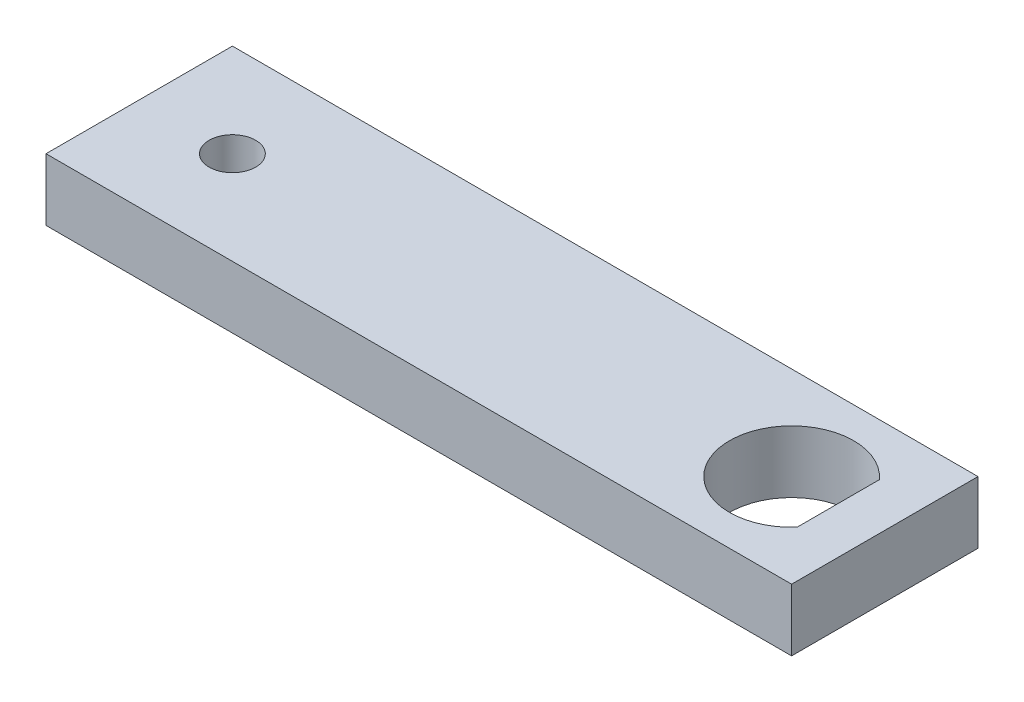
ISO-10303-21;
HEADER;
FILE_DESCRIPTION(('STEP AP214'),'2;1');
FILE_NAME('part.step','',(''),(''),'','','');
FILE_SCHEMA(('AUTOMOTIVE_DESIGN { 1 0 10303 214 1 1 1 1 }'));
ENDSEC;
DATA;
#1=APPLICATION_CONTEXT('core data for automotive mechanical design processes');
#2=APPLICATION_PROTOCOL_DEFINITION('international standard','automotive_design',2000,#1);
#3=PRODUCT_CONTEXT('',#1,'mechanical');
#4=PRODUCT('Part','Part','',(#3));
#5=PRODUCT_RELATED_PRODUCT_CATEGORY('part','',(#4));
#6=PRODUCT_DEFINITION_FORMATION('','',#4);
#7=PRODUCT_DEFINITION_CONTEXT('part definition',#1,'design');
#8=PRODUCT_DEFINITION('design','',#6,#7);
#9=PRODUCT_DEFINITION_SHAPE('','',#8);
#10=(LENGTH_UNIT() NAMED_UNIT(*) SI_UNIT(.MILLI.,.METRE.));
#11=(NAMED_UNIT(*) PLANE_ANGLE_UNIT() SI_UNIT($,.RADIAN.));
#12=(NAMED_UNIT(*) SI_UNIT($,.STERADIAN.) SOLID_ANGLE_UNIT());
#13=UNCERTAINTY_MEASURE_WITH_UNIT(LENGTH_MEASURE(1.E-05),#10,'distance_accuracy_value','');
#14=(GEOMETRIC_REPRESENTATION_CONTEXT(3) GLOBAL_UNCERTAINTY_ASSIGNED_CONTEXT((#13)) GLOBAL_UNIT_ASSIGNED_CONTEXT((#10,
#11,#12)) REPRESENTATION_CONTEXT('',''));
#15=CARTESIAN_POINT('',(0.,0.,0.));
#16=DIRECTION('',(0.,0.,1.));
#17=DIRECTION('',(1.,0.,0.));
#18=AXIS2_PLACEMENT_3D('',#15,#16,#17);
#19=CARTESIAN_POINT('',(0.,0.,19.05));
#20=DIRECTION('',(-1.,0.,0.));
#21=DIRECTION('',(0.,0.,1.));
#22=AXIS2_PLACEMENT_3D('',#19,#20,#21);
#23=PLANE('',#22);
#24=DIRECTION('',(0.,1.,0.));
#25=VECTOR('',#24,1.);
#26=CARTESIAN_POINT('',(0.,0.,0.));
#27=LINE('',#26,#25);
#28=CARTESIAN_POINT('',(0.,0.,0.));
#29=VERTEX_POINT('',#28);
#30=CARTESIAN_POINT('',(0.,6.35000000000001,0.));
#31=VERTEX_POINT('',#30);
#32=EDGE_CURVE('E90',#29,#31,#27,.T.);
#33=ORIENTED_EDGE('',*,*,#32,.F.);
#34=DIRECTION('',(0.,0.,-1.));
#35=VECTOR('',#34,1.);
#36=CARTESIAN_POINT('',(0.,0.,19.05));
#37=LINE('',#36,#35);
#38=CARTESIAN_POINT('',(0.,0.,19.05));
#39=VERTEX_POINT('',#38);
#40=EDGE_CURVE('E11',#39,#29,#37,.T.);
#41=ORIENTED_EDGE('',*,*,#40,.F.);
#42=DIRECTION('',(0.,1.,0.));
#43=VECTOR('',#42,1.);
#44=CARTESIAN_POINT('',(0.,0.,19.05));
#45=LINE('',#44,#43);
#46=CARTESIAN_POINT('',(0.,6.35000000000001,19.05));
#47=VERTEX_POINT('',#46);
#48=EDGE_CURVE('E123',#39,#47,#45,.T.);
#49=ORIENTED_EDGE('',*,*,#48,.T.);
#50=DIRECTION('',(0.,0.,-1.));
#51=VECTOR('',#50,1.);
#52=CARTESIAN_POINT('',(0.,6.35000000000001,19.05));
#53=LINE('',#52,#51);
#54=EDGE_CURVE('E38',#47,#31,#53,.T.);
#55=ORIENTED_EDGE('',*,*,#54,.T.);
#56=EDGE_LOOP('',(#33,#41,#49,#55));
#57=FACE_BOUND('',#56,.T.);
#58=ADVANCED_FACE('F35',(#57),#23,.T.);
#59=CARTESIAN_POINT('',(0.,0.,19.05));
#60=DIRECTION('',(0.,1.,0.));
#61=DIRECTION('',(-1.,0.,0.));
#62=AXIS2_PLACEMENT_3D('',#59,#60,#61);
#63=PLANE('',#62);
#64=CARTESIAN_POINT('',(9.525,0.,9.525));
#65=DIRECTION('',(0.,1.,0.));
#66=DIRECTION('',(-1.,0.,0.));
#67=AXIS2_PLACEMENT_3D('',#64,#65,#66);
#68=CIRCLE('',#67,2.38125);
#69=CARTESIAN_POINT('',(7.14375,0.,9.525));
#70=VERTEX_POINT('',#69);
#71=EDGE_CURVE('E100',#70,#70,#68,.T.);
#72=ORIENTED_EDGE('',*,*,#71,.T.);
#73=EDGE_LOOP('',(#72));
#74=FACE_BOUND('',#73,.T.);
#75=DIRECTION('',(0.,0.,1.));
#76=VECTOR('',#75,1.);
#77=CARTESIAN_POINT('',(71.4375,0.,5.32486979368498));
#78=LINE('',#77,#76);
#79=CARTESIAN_POINT('',(71.4375,0.,5.32486979368498));
#80=VERTEX_POINT('',#79);
#81=CARTESIAN_POINT('',(71.4375,0.,13.725130206315));
#82=VERTEX_POINT('',#81);
#83=EDGE_CURVE('E108',#80,#82,#78,.T.);
#84=ORIENTED_EDGE('',*,*,#83,.F.);
#85=CARTESIAN_POINT('',(66.675,0.,9.525));
#86=DIRECTION('',(0.,1.,0.));
#87=DIRECTION('',(-1.,0.,0.));
#88=AXIS2_PLACEMENT_3D('',#85,#86,#87);
#89=CIRCLE('',#88,6.35);
#90=EDGE_CURVE('E51',#80,#82,#89,.T.);
#91=ORIENTED_EDGE('',*,*,#90,.T.);
#92=EDGE_LOOP('',(#84,#91));
#93=FACE_BOUND('',#92,.T.);
#94=DIRECTION('',(1.,0.,0.));
#95=VECTOR('',#94,1.);
#96=CARTESIAN_POINT('',(0.,0.,0.));
#97=LINE('',#96,#95);
#98=CARTESIAN_POINT('',(76.2,0.,0.));
#99=VERTEX_POINT('',#98);
#100=EDGE_CURVE('E119',#29,#99,#97,.T.);
#101=ORIENTED_EDGE('',*,*,#100,.T.);
#102=DIRECTION('',(0.,0.,-1.));
#103=VECTOR('',#102,1.);
#104=CARTESIAN_POINT('',(76.2,0.,19.05));
#105=LINE('',#104,#103);
#106=CARTESIAN_POINT('',(76.2,0.,19.05));
#107=VERTEX_POINT('',#106);
#108=EDGE_CURVE('E43',#107,#99,#105,.T.);
#109=ORIENTED_EDGE('',*,*,#108,.F.);
#110=DIRECTION('',(1.,0.,0.));
#111=VECTOR('',#110,1.);
#112=CARTESIAN_POINT('',(0.,0.,19.05));
#113=LINE('',#112,#111);
#114=EDGE_CURVE('E131',#39,#107,#113,.T.);
#115=ORIENTED_EDGE('',*,*,#114,.F.);
#116=ORIENTED_EDGE('',*,*,#40,.T.);
#117=EDGE_LOOP('',(#101,#109,#115,#116));
#118=FACE_BOUND('',#117,.T.);
#119=ADVANCED_FACE('F146',(#74,#93,#118),#63,.F.);
#120=CARTESIAN_POINT('',(76.2,6.35,19.05));
#121=DIRECTION('',(1.,0.,0.));
#122=DIRECTION('',(0.,0.,-1.));
#123=AXIS2_PLACEMENT_3D('',#120,#121,#122);
#124=PLANE('',#123);
#125=DIRECTION('',(0.,-1.,0.));
#126=VECTOR('',#125,1.);
#127=CARTESIAN_POINT('',(76.2,6.35,0.));
#128=LINE('',#127,#126);
#129=CARTESIAN_POINT('',(76.2,6.35,0.));
#130=VERTEX_POINT('',#129);
#131=EDGE_CURVE('E116',#130,#99,#128,.T.);
#132=ORIENTED_EDGE('',*,*,#131,.F.);
#133=DIRECTION('',(0.,0.,-1.));
#134=VECTOR('',#133,1.);
#135=CARTESIAN_POINT('',(76.2,6.35,19.05));
#136=LINE('',#135,#134);
#137=CARTESIAN_POINT('',(76.2,6.35,19.05));
#138=VERTEX_POINT('',#137);
#139=EDGE_CURVE('E133',#138,#130,#136,.T.);
#140=ORIENTED_EDGE('',*,*,#139,.F.);
#141=DIRECTION('',(0.,-1.,0.));
#142=VECTOR('',#141,1.);
#143=CARTESIAN_POINT('',(76.2,6.35,19.05));
#144=LINE('',#143,#142);
#145=EDGE_CURVE('E128',#138,#107,#144,.T.);
#146=ORIENTED_EDGE('',*,*,#145,.T.);
#147=ORIENTED_EDGE('',*,*,#108,.T.);
#148=EDGE_LOOP('',(#132,#140,#146,#147));
#149=FACE_BOUND('',#148,.T.);
#150=ADVANCED_FACE('F152',(#149),#124,.T.);
#151=CARTESIAN_POINT('',(76.2,6.35,19.05));
#152=DIRECTION('',(0.,-1.,0.));
#153=DIRECTION('',(1.,0.,0.));
#154=AXIS2_PLACEMENT_3D('',#151,#152,#153);
#155=PLANE('',#154);
#156=CARTESIAN_POINT('',(9.525,6.35000000000001,9.525));
#157=DIRECTION('',(0.,1.,0.));
#158=DIRECTION('',(-1.,0.,0.));
#159=AXIS2_PLACEMENT_3D('',#156,#157,#158);
#160=CIRCLE('',#159,2.38125);
#161=CARTESIAN_POINT('',(7.14375,6.35000000000001,9.525));
#162=VERTEX_POINT('',#161);
#163=EDGE_CURVE('E103',#162,#162,#160,.T.);
#164=ORIENTED_EDGE('',*,*,#163,.F.);
#165=EDGE_LOOP('',(#164));
#166=FACE_BOUND('',#165,.T.);
#167=DIRECTION('',(0.,0.,1.));
#168=VECTOR('',#167,1.);
#169=CARTESIAN_POINT('',(71.4375,6.35,5.32486979368498));
#170=LINE('',#169,#168);
#171=CARTESIAN_POINT('',(71.4375,6.35,5.32486979368498));
#172=VERTEX_POINT('',#171);
#173=CARTESIAN_POINT('',(71.4375,6.35,13.725130206315));
#174=VERTEX_POINT('',#173);
#175=EDGE_CURVE('E94',#172,#174,#170,.T.);
#176=ORIENTED_EDGE('',*,*,#175,.T.);
#177=CARTESIAN_POINT('',(66.675,6.35,9.525));
#178=DIRECTION('',(0.,1.,0.));
#179=DIRECTION('',(-1.,0.,0.));
#180=AXIS2_PLACEMENT_3D('',#177,#178,#179);
#181=CIRCLE('',#180,6.35);
#182=EDGE_CURVE('E56',#172,#174,#181,.T.);
#183=ORIENTED_EDGE('',*,*,#182,.F.);
#184=EDGE_LOOP('',(#176,#183));
#185=FACE_BOUND('',#184,.T.);
#186=DIRECTION('',(-1.,0.,0.));
#187=VECTOR('',#186,1.);
#188=CARTESIAN_POINT('',(76.2,6.35,0.));
#189=LINE('',#188,#187);
#190=EDGE_CURVE('E113',#130,#31,#189,.T.);
#191=ORIENTED_EDGE('',*,*,#190,.T.);
#192=ORIENTED_EDGE('',*,*,#54,.F.);
#193=DIRECTION('',(-1.,0.,0.));
#194=VECTOR('',#193,1.);
#195=CARTESIAN_POINT('',(76.2,6.35,19.05));
#196=LINE('',#195,#194);
#197=EDGE_CURVE('E126',#138,#47,#196,.T.);
#198=ORIENTED_EDGE('',*,*,#197,.F.);
#199=ORIENTED_EDGE('',*,*,#139,.T.);
#200=EDGE_LOOP('',(#191,#192,#198,#199));
#201=FACE_BOUND('',#200,.T.);
#202=ADVANCED_FACE('F98',(#166,#185,#201),#155,.F.);
#203=CARTESIAN_POINT('',(0.,0.,19.05));
#204=DIRECTION('',(0.,0.,-1.));
#205=DIRECTION('',(-1.,0.,0.));
#206=AXIS2_PLACEMENT_3D('',#203,#204,#205);
#207=PLANE('',#206);
#208=ORIENTED_EDGE('',*,*,#48,.F.);
#209=ORIENTED_EDGE('',*,*,#114,.T.);
#210=ORIENTED_EDGE('',*,*,#145,.F.);
#211=ORIENTED_EDGE('',*,*,#197,.T.);
#212=EDGE_LOOP('',(#208,#209,#210,#211));
#213=FACE_BOUND('',#212,.T.);
#214=ADVANCED_FACE('F150',(#213),#207,.F.);
#215=CARTESIAN_POINT('',(0.,0.,0.));
#216=DIRECTION('',(0.,0.,-1.));
#217=DIRECTION('',(-1.,0.,0.));
#218=AXIS2_PLACEMENT_3D('',#215,#216,#217);
#219=PLANE('',#218);
#220=ORIENTED_EDGE('',*,*,#32,.T.);
#221=ORIENTED_EDGE('',*,*,#190,.F.);
#222=ORIENTED_EDGE('',*,*,#131,.T.);
#223=ORIENTED_EDGE('',*,*,#100,.F.);
#224=EDGE_LOOP('',(#220,#221,#222,#223));
#225=FACE_BOUND('',#224,.T.);
#226=ADVANCED_FACE('F143',(#225),#219,.T.);
#227=CARTESIAN_POINT('',(66.675,0.,9.525));
#228=DIRECTION('',(0.,1.,0.));
#229=DIRECTION('',(-1.,0.,0.));
#230=AXIS2_PLACEMENT_3D('',#227,#228,#229);
#231=CYLINDRICAL_SURFACE('',#230,6.35);
#232=ORIENTED_EDGE('',*,*,#182,.T.);
#233=DIRECTION('',(0.,1.,0.));
#234=VECTOR('',#233,1.);
#235=CARTESIAN_POINT('',(71.4375,0.,13.725130206315));
#236=LINE('',#235,#234);
#237=EDGE_CURVE('E91',#82,#174,#236,.T.);
#238=ORIENTED_EDGE('',*,*,#237,.F.);
#239=ORIENTED_EDGE('',*,*,#90,.F.);
#240=DIRECTION('',(0.,1.,0.));
#241=VECTOR('',#240,1.);
#242=CARTESIAN_POINT('',(71.4375,0.,5.32486979368498));
#243=LINE('',#242,#241);
#244=EDGE_CURVE('E85',#80,#172,#243,.T.);
#245=ORIENTED_EDGE('',*,*,#244,.T.);
#246=EDGE_LOOP('',(#232,#238,#239,#245));
#247=FACE_BOUND('',#246,.T.);
#248=ADVANCED_FACE('F87',(#247),#231,.F.);
#249=CARTESIAN_POINT('',(71.4375,0.,5.32486979368498));
#250=DIRECTION('',(-1.,0.,0.));
#251=DIRECTION('',(0.,-1.,0.));
#252=AXIS2_PLACEMENT_3D('',#249,#250,#251);
#253=PLANE('',#252);
#254=ORIENTED_EDGE('',*,*,#175,.F.);
#255=ORIENTED_EDGE('',*,*,#244,.F.);
#256=ORIENTED_EDGE('',*,*,#83,.T.);
#257=ORIENTED_EDGE('',*,*,#237,.T.);
#258=EDGE_LOOP('',(#254,#255,#256,#257));
#259=FACE_BOUND('',#258,.T.);
#260=ADVANCED_FACE('F95',(#259),#253,.T.);
#261=CARTESIAN_POINT('',(9.525,0.,9.525));
#262=DIRECTION('',(0.,1.,0.));
#263=DIRECTION('',(-1.,0.,0.));
#264=AXIS2_PLACEMENT_3D('',#261,#262,#263);
#265=CYLINDRICAL_SURFACE('',#264,2.38125);
#266=ORIENTED_EDGE('',*,*,#71,.F.);
#267=EDGE_LOOP('',(#266));
#268=FACE_BOUND('',#267,.T.);
#269=ORIENTED_EDGE('',*,*,#163,.T.);
#270=EDGE_LOOP('',(#269));
#271=FACE_BOUND('',#270,.T.);
#272=ADVANCED_FACE('F189',(#268,#271),#265,.F.);
#273=CLOSED_SHELL('',(#58,#119,#150,#202,#214,#226,#248,#260,#272));
#274=MANIFOLD_SOLID_BREP('B2',#273);
#275=ADVANCED_BREP_SHAPE_REPRESENTATION('',(#18,#274),#14);
#276=SHAPE_DEFINITION_REPRESENTATION(#9,#275);
ENDSEC;
END-ISO-10303-21;
